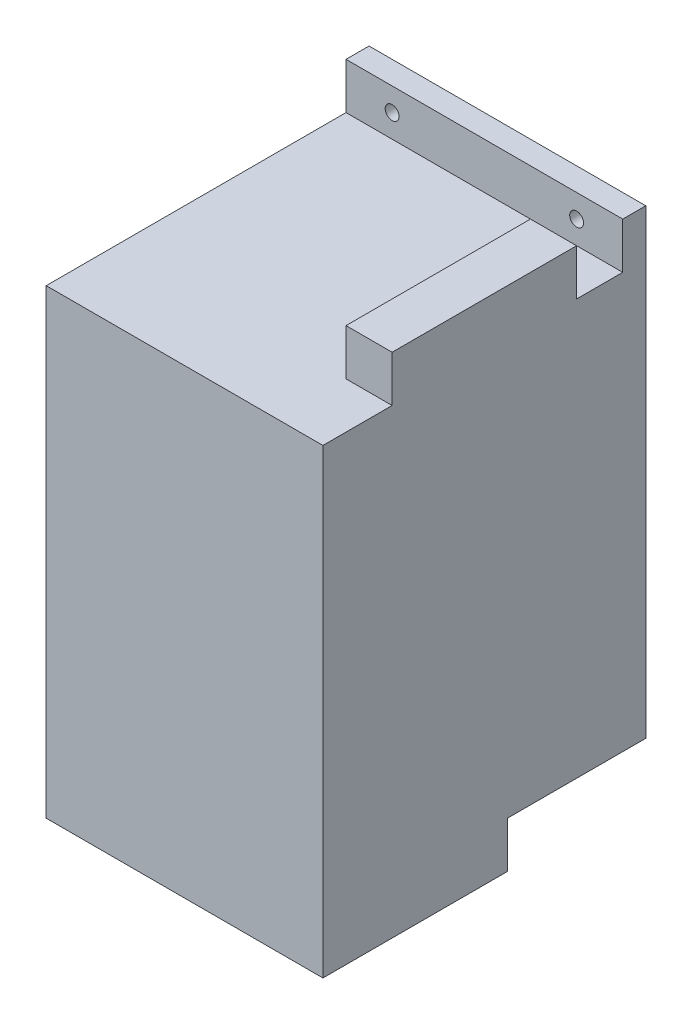
ISO-10303-21;
HEADER;
FILE_DESCRIPTION(('STEP AP214'),'2;1');
FILE_NAME('part.step','',(''),(''),'','','');
FILE_SCHEMA(('AUTOMOTIVE_DESIGN { 1 0 10303 214 1 1 1 1 }'));
ENDSEC;
DATA;
#1=APPLICATION_CONTEXT('core data for automotive mechanical design processes');
#2=APPLICATION_PROTOCOL_DEFINITION('international standard','automotive_design',2000,#1);
#3=PRODUCT_CONTEXT('',#1,'mechanical');
#4=PRODUCT('Part','Part','',(#3));
#5=PRODUCT_RELATED_PRODUCT_CATEGORY('part','',(#4));
#6=PRODUCT_DEFINITION_FORMATION('','',#4);
#7=PRODUCT_DEFINITION_CONTEXT('part definition',#1,'design');
#8=PRODUCT_DEFINITION('design','',#6,#7);
#9=PRODUCT_DEFINITION_SHAPE('','',#8);
#10=(LENGTH_UNIT() NAMED_UNIT(*) SI_UNIT(.MILLI.,.METRE.));
#11=(NAMED_UNIT(*) PLANE_ANGLE_UNIT() SI_UNIT($,.RADIAN.));
#12=(NAMED_UNIT(*) SI_UNIT($,.STERADIAN.) SOLID_ANGLE_UNIT());
#13=UNCERTAINTY_MEASURE_WITH_UNIT(LENGTH_MEASURE(1.E-05),#10,'distance_accuracy_value','');
#14=(GEOMETRIC_REPRESENTATION_CONTEXT(3) GLOBAL_UNCERTAINTY_ASSIGNED_CONTEXT((#13)) GLOBAL_UNIT_ASSIGNED_CONTEXT((#10,
#11,#12)) REPRESENTATION_CONTEXT('',''));
#15=CARTESIAN_POINT('',(0.,0.,0.));
#16=DIRECTION('',(0.,0.,1.));
#17=DIRECTION('',(1.,0.,0.));
#18=AXIS2_PLACEMENT_3D('',#15,#16,#17);
#19=CARTESIAN_POINT('',(0.,100.,-70.));
#20=DIRECTION('',(0.,0.,1.));
#21=DIRECTION('',(1.,0.,0.));
#22=AXIS2_PLACEMENT_3D('',#19,#20,#21);
#23=PLANE('',#22);
#24=CARTESIAN_POINT('',(9.99999999999999,105.,-70.));
#25=DIRECTION('',(0.,0.,-1.));
#26=DIRECTION('',(-1.,0.,0.));
#27=AXIS2_PLACEMENT_3D('',#24,#25,#26);
#28=CIRCLE('',#27,1.5);
#29=CARTESIAN_POINT('',(8.49999999999999,105.,-70.));
#30=VERTEX_POINT('',#29);
#31=EDGE_CURVE('E147',#30,#30,#28,.T.);
#32=ORIENTED_EDGE('',*,*,#31,.F.);
#33=EDGE_LOOP('',(#32));
#34=FACE_BOUND('',#33,.T.);
#35=CARTESIAN_POINT('',(50.,105.,-70.));
#36=DIRECTION('',(0.,0.,-1.));
#37=DIRECTION('',(-1.,0.,0.));
#38=AXIS2_PLACEMENT_3D('',#35,#36,#37);
#39=CIRCLE('',#38,1.5);
#40=CARTESIAN_POINT('',(48.5,105.,-70.));
#41=VERTEX_POINT('',#40);
#42=EDGE_CURVE('E152',#41,#41,#39,.T.);
#43=ORIENTED_EDGE('',*,*,#42,.F.);
#44=EDGE_LOOP('',(#43));
#45=FACE_BOUND('',#44,.T.);
#46=DIRECTION('',(1.,0.,0.));
#47=VECTOR('',#46,1.);
#48=CARTESIAN_POINT('',(60.,10.,-70.));
#49=LINE('',#48,#47);
#50=CARTESIAN_POINT('',(0.,10.,-70.));
#51=VERTEX_POINT('',#50);
#52=CARTESIAN_POINT('',(60.,10.,-70.));
#53=VERTEX_POINT('',#52);
#54=EDGE_CURVE('E136',#51,#53,#49,.T.);
#55=ORIENTED_EDGE('',*,*,#54,.F.);
#56=DIRECTION('',(0.,-1.,0.));
#57=VECTOR('',#56,1.);
#58=CARTESIAN_POINT('',(0.,100.,-70.));
#59=LINE('',#58,#57);
#60=CARTESIAN_POINT('',(0.,110.,-70.));
#61=VERTEX_POINT('',#60);
#62=EDGE_CURVE('E213',#61,#51,#59,.T.);
#63=ORIENTED_EDGE('',*,*,#62,.F.);
#64=DIRECTION('',(-1.,0.,0.));
#65=VECTOR('',#64,1.);
#66=CARTESIAN_POINT('',(60.,110.,-70.));
#67=LINE('',#66,#65);
#68=CARTESIAN_POINT('',(60.,110.,-70.));
#69=VERTEX_POINT('',#68);
#70=EDGE_CURVE('E161',#69,#61,#67,.T.);
#71=ORIENTED_EDGE('',*,*,#70,.F.);
#72=DIRECTION('',(0.,-1.,0.));
#73=VECTOR('',#72,1.);
#74=CARTESIAN_POINT('',(60.,100.,-70.));
#75=LINE('',#74,#73);
#76=EDGE_CURVE('E220',#69,#53,#75,.T.);
#77=ORIENTED_EDGE('',*,*,#76,.T.);
#78=EDGE_LOOP('',(#55,#63,#71,#77));
#79=FACE_BOUND('',#78,.T.);
#80=ADVANCED_FACE('F34',(#34,#45,#79),#23,.F.);
#81=CARTESIAN_POINT('',(0.,100.,0.));
#82=DIRECTION('',(0.,-1.,0.));
#83=DIRECTION('',(0.,0.,-1.));
#84=AXIS2_PLACEMENT_3D('',#81,#82,#83);
#85=PLANE('',#84);
#86=DIRECTION('',(1.,0.,0.));
#87=VECTOR('',#86,1.);
#88=CARTESIAN_POINT('',(60.,100.,-65.));
#89=LINE('',#88,#87);
#90=CARTESIAN_POINT('',(0.,100.,-65.));
#91=VERTEX_POINT('',#90);
#92=CARTESIAN_POINT('',(60.,100.,-65.));
#93=VERTEX_POINT('',#92);
#94=EDGE_CURVE('E59',#91,#93,#89,.T.);
#95=ORIENTED_EDGE('',*,*,#94,.F.);
#96=DIRECTION('',(0.,0.,1.));
#97=VECTOR('',#96,1.);
#98=CARTESIAN_POINT('',(0.,100.,0.));
#99=LINE('',#98,#97);
#100=CARTESIAN_POINT('',(0.,100.,0.));
#101=VERTEX_POINT('',#100);
#102=EDGE_CURVE('E206',#91,#101,#99,.T.);
#103=ORIENTED_EDGE('',*,*,#102,.T.);
#104=DIRECTION('',(1.,0.,0.));
#105=VECTOR('',#104,1.);
#106=CARTESIAN_POINT('',(0.,100.,0.));
#107=LINE('',#106,#105);
#108=CARTESIAN_POINT('',(60.,100.,0.));
#109=VERTEX_POINT('',#108);
#110=EDGE_CURVE('E208',#101,#109,#107,.T.);
#111=ORIENTED_EDGE('',*,*,#110,.T.);
#112=DIRECTION('',(0.,0.,-1.));
#113=VECTOR('',#112,1.);
#114=CARTESIAN_POINT('',(60.,100.,0.));
#115=LINE('',#114,#113);
#116=CARTESIAN_POINT('',(60.,100.,-15.));
#117=VERTEX_POINT('',#116);
#118=EDGE_CURVE('E211',#109,#117,#115,.T.);
#119=ORIENTED_EDGE('',*,*,#118,.T.);
#120=DIRECTION('',(1.,0.,0.));
#121=VECTOR('',#120,1.);
#122=CARTESIAN_POINT('',(50.,100.,-15.));
#123=LINE('',#122,#121);
#124=CARTESIAN_POINT('',(50.,100.,-15.));
#125=VERTEX_POINT('',#124);
#126=EDGE_CURVE('E189',#125,#117,#123,.T.);
#127=ORIENTED_EDGE('',*,*,#126,.F.);
#128=DIRECTION('',(0.,0.,1.));
#129=VECTOR('',#128,1.);
#130=CARTESIAN_POINT('',(50.,100.,-15.));
#131=LINE('',#130,#129);
#132=CARTESIAN_POINT('',(50.,100.,-55.));
#133=VERTEX_POINT('',#132);
#134=EDGE_CURVE('E175',#133,#125,#131,.T.);
#135=ORIENTED_EDGE('',*,*,#134,.F.);
#136=DIRECTION('',(-1.,0.,0.));
#137=VECTOR('',#136,1.);
#138=CARTESIAN_POINT('',(50.,100.,-55.));
#139=LINE('',#138,#137);
#140=CARTESIAN_POINT('',(60.,100.,-55.));
#141=VERTEX_POINT('',#140);
#142=EDGE_CURVE('E180',#141,#133,#139,.T.);
#143=ORIENTED_EDGE('',*,*,#142,.F.);
#144=EDGE_CURVE('E210',#141,#93,#115,.T.);
#145=ORIENTED_EDGE('',*,*,#144,.T.);
#146=EDGE_LOOP('',(#95,#103,#111,#119,#127,#135,#143,#145));
#147=FACE_BOUND('',#146,.T.);
#148=ADVANCED_FACE('F244',(#147),#85,.F.);
#149=CARTESIAN_POINT('',(0.,100.,0.));
#150=DIRECTION('',(1.,0.,0.));
#151=DIRECTION('',(0.,0.,-1.));
#152=AXIS2_PLACEMENT_3D('',#149,#150,#151);
#153=PLANE('',#152);
#154=DIRECTION('',(0.,0.,-1.));
#155=VECTOR('',#154,1.);
#156=CARTESIAN_POINT('',(0.,10.,-70.));
#157=LINE('',#156,#155);
#158=CARTESIAN_POINT('',(0.,10.,-40.));
#159=VERTEX_POINT('',#158);
#160=EDGE_CURVE('E130',#159,#51,#157,.T.);
#161=ORIENTED_EDGE('',*,*,#160,.F.);
#162=DIRECTION('',(0.,-1.,0.));
#163=VECTOR('',#162,1.);
#164=CARTESIAN_POINT('',(0.,10.,-40.));
#165=LINE('',#164,#163);
#166=CARTESIAN_POINT('',(0.,0.,-40.));
#167=VERTEX_POINT('',#166);
#168=EDGE_CURVE('E127',#159,#167,#165,.T.);
#169=ORIENTED_EDGE('',*,*,#168,.T.);
#170=DIRECTION('',(0.,0.,1.));
#171=VECTOR('',#170,1.);
#172=CARTESIAN_POINT('',(0.,0.,0.));
#173=LINE('',#172,#171);
#174=CARTESIAN_POINT('',(0.,0.,0.));
#175=VERTEX_POINT('',#174);
#176=EDGE_CURVE('E205',#167,#175,#173,.T.);
#177=ORIENTED_EDGE('',*,*,#176,.T.);
#178=DIRECTION('',(0.,-1.,0.));
#179=VECTOR('',#178,1.);
#180=CARTESIAN_POINT('',(0.,100.,0.));
#181=LINE('',#180,#179);
#182=EDGE_CURVE('E11',#101,#175,#181,.T.);
#183=ORIENTED_EDGE('',*,*,#182,.F.);
#184=ORIENTED_EDGE('',*,*,#102,.F.);
#185=DIRECTION('',(0.,-1.,0.));
#186=VECTOR('',#185,1.);
#187=CARTESIAN_POINT('',(0.,110.,-65.));
#188=LINE('',#187,#186);
#189=CARTESIAN_POINT('',(0.,110.,-65.));
#190=VERTEX_POINT('',#189);
#191=EDGE_CURVE('E172',#190,#91,#188,.T.);
#192=ORIENTED_EDGE('',*,*,#191,.F.);
#193=DIRECTION('',(0.,0.,1.));
#194=VECTOR('',#193,1.);
#195=CARTESIAN_POINT('',(0.,110.,-70.));
#196=LINE('',#195,#194);
#197=EDGE_CURVE('E164',#61,#190,#196,.T.);
#198=ORIENTED_EDGE('',*,*,#197,.F.);
#199=ORIENTED_EDGE('',*,*,#62,.T.);
#200=EDGE_LOOP('',(#161,#169,#177,#183,#184,#192,#198,#199));
#201=FACE_BOUND('',#200,.T.);
#202=ADVANCED_FACE('F36',(#201),#153,.F.);
#203=CARTESIAN_POINT('',(0.,100.,0.));
#204=DIRECTION('',(0.,0.,-1.));
#205=DIRECTION('',(-1.,0.,0.));
#206=AXIS2_PLACEMENT_3D('',#203,#204,#205);
#207=PLANE('',#206);
#208=DIRECTION('',(1.,0.,0.));
#209=VECTOR('',#208,1.);
#210=CARTESIAN_POINT('',(0.,0.,0.));
#211=LINE('',#210,#209);
#212=CARTESIAN_POINT('',(60.,0.,0.));
#213=VERTEX_POINT('',#212);
#214=EDGE_CURVE('E215',#175,#213,#211,.T.);
#215=ORIENTED_EDGE('',*,*,#214,.T.);
#216=DIRECTION('',(0.,-1.,0.));
#217=VECTOR('',#216,1.);
#218=CARTESIAN_POINT('',(60.,100.,0.));
#219=LINE('',#218,#217);
#220=EDGE_CURVE('E43',#109,#213,#219,.T.);
#221=ORIENTED_EDGE('',*,*,#220,.F.);
#222=ORIENTED_EDGE('',*,*,#110,.F.);
#223=ORIENTED_EDGE('',*,*,#182,.T.);
#224=EDGE_LOOP('',(#215,#221,#222,#223));
#225=FACE_BOUND('',#224,.T.);
#226=ADVANCED_FACE('F257',(#225),#207,.F.);
#227=CARTESIAN_POINT('',(60.,100.,0.));
#228=DIRECTION('',(-1.,0.,0.));
#229=DIRECTION('',(0.,0.,1.));
#230=AXIS2_PLACEMENT_3D('',#227,#228,#229);
#231=PLANE('',#230);
#232=DIRECTION('',(0.,0.,-1.));
#233=VECTOR('',#232,1.);
#234=CARTESIAN_POINT('',(60.,0.,0.));
#235=LINE('',#234,#233);
#236=CARTESIAN_POINT('',(60.,0.,-40.));
#237=VERTEX_POINT('',#236);
#238=EDGE_CURVE('E145',#213,#237,#235,.T.);
#239=ORIENTED_EDGE('',*,*,#238,.T.);
#240=DIRECTION('',(0.,-1.,0.));
#241=VECTOR('',#240,1.);
#242=CARTESIAN_POINT('',(60.,10.,-40.));
#243=LINE('',#242,#241);
#244=CARTESIAN_POINT('',(60.,10.,-40.));
#245=VERTEX_POINT('',#244);
#246=EDGE_CURVE('E51',#245,#237,#243,.T.);
#247=ORIENTED_EDGE('',*,*,#246,.F.);
#248=DIRECTION('',(0.,0.,1.));
#249=VECTOR('',#248,1.);
#250=CARTESIAN_POINT('',(60.,10.,-70.));
#251=LINE('',#250,#249);
#252=EDGE_CURVE('E131',#53,#245,#251,.T.);
#253=ORIENTED_EDGE('',*,*,#252,.F.);
#254=ORIENTED_EDGE('',*,*,#76,.F.);
#255=DIRECTION('',(0.,0.,-1.));
#256=VECTOR('',#255,1.);
#257=CARTESIAN_POINT('',(60.,110.,-70.));
#258=LINE('',#257,#256);
#259=CARTESIAN_POINT('',(60.,110.,-65.));
#260=VERTEX_POINT('',#259);
#261=EDGE_CURVE('E158',#260,#69,#258,.T.);
#262=ORIENTED_EDGE('',*,*,#261,.F.);
#263=DIRECTION('',(0.,-1.,0.));
#264=VECTOR('',#263,1.);
#265=CARTESIAN_POINT('',(60.,110.,-65.));
#266=LINE('',#265,#264);
#267=EDGE_CURVE('E168',#260,#93,#266,.T.);
#268=ORIENTED_EDGE('',*,*,#267,.T.);
#269=ORIENTED_EDGE('',*,*,#144,.F.);
#270=DIRECTION('',(0.,-1.,0.));
#271=VECTOR('',#270,1.);
#272=CARTESIAN_POINT('',(60.,110.,-55.));
#273=LINE('',#272,#271);
#274=CARTESIAN_POINT('',(60.,110.,-55.));
#275=VERTEX_POINT('',#274);
#276=EDGE_CURVE('E196',#275,#141,#273,.T.);
#277=ORIENTED_EDGE('',*,*,#276,.F.);
#278=DIRECTION('',(0.,0.,-1.));
#279=VECTOR('',#278,1.);
#280=CARTESIAN_POINT('',(60.,110.,-15.));
#281=LINE('',#280,#279);
#282=CARTESIAN_POINT('',(60.,110.,-15.));
#283=VERTEX_POINT('',#282);
#284=EDGE_CURVE('E182',#283,#275,#281,.T.);
#285=ORIENTED_EDGE('',*,*,#284,.F.);
#286=DIRECTION('',(0.,-1.,0.));
#287=VECTOR('',#286,1.);
#288=CARTESIAN_POINT('',(60.,110.,-15.));
#289=LINE('',#288,#287);
#290=EDGE_CURVE('E199',#283,#117,#289,.T.);
#291=ORIENTED_EDGE('',*,*,#290,.T.);
#292=ORIENTED_EDGE('',*,*,#118,.F.);
#293=ORIENTED_EDGE('',*,*,#220,.T.);
#294=EDGE_LOOP('',(#239,#247,#253,#254,#262,#268,#269,#277,#285,#291,#292,#293));
#295=FACE_BOUND('',#294,.T.);
#296=ADVANCED_FACE('F142',(#295),#231,.F.);
#297=CARTESIAN_POINT('',(0.,0.,0.));
#298=DIRECTION('',(0.,-1.,0.));
#299=DIRECTION('',(0.,0.,-1.));
#300=AXIS2_PLACEMENT_3D('',#297,#298,#299);
#301=PLANE('',#300);
#302=DIRECTION('',(-1.,0.,0.));
#303=VECTOR('',#302,1.);
#304=CARTESIAN_POINT('',(60.,0.,-40.));
#305=LINE('',#304,#303);
#306=EDGE_CURVE('E139',#237,#167,#305,.T.);
#307=ORIENTED_EDGE('',*,*,#306,.F.);
#308=ORIENTED_EDGE('',*,*,#238,.F.);
#309=ORIENTED_EDGE('',*,*,#214,.F.);
#310=ORIENTED_EDGE('',*,*,#176,.F.);
#311=EDGE_LOOP('',(#307,#308,#309,#310));
#312=FACE_BOUND('',#311,.T.);
#313=ADVANCED_FACE('F255',(#312),#301,.T.);
#314=CARTESIAN_POINT('',(50.,110.,-15.));
#315=DIRECTION('',(1.,0.,0.));
#316=DIRECTION('',(0.,0.,-1.));
#317=AXIS2_PLACEMENT_3D('',#314,#315,#316);
#318=PLANE('',#317);
#319=ORIENTED_EDGE('',*,*,#134,.T.);
#320=DIRECTION('',(0.,-1.,0.));
#321=VECTOR('',#320,1.);
#322=CARTESIAN_POINT('',(50.,110.,-15.));
#323=LINE('',#322,#321);
#324=CARTESIAN_POINT('',(50.,110.,-15.));
#325=VERTEX_POINT('',#324);
#326=EDGE_CURVE('E202',#325,#125,#323,.T.);
#327=ORIENTED_EDGE('',*,*,#326,.F.);
#328=DIRECTION('',(0.,0.,1.));
#329=VECTOR('',#328,1.);
#330=CARTESIAN_POINT('',(50.,110.,-15.));
#331=LINE('',#330,#329);
#332=CARTESIAN_POINT('',(50.,110.,-55.));
#333=VERTEX_POINT('',#332);
#334=EDGE_CURVE('E176',#333,#325,#331,.T.);
#335=ORIENTED_EDGE('',*,*,#334,.F.);
#336=DIRECTION('',(0.,-1.,0.));
#337=VECTOR('',#336,1.);
#338=CARTESIAN_POINT('',(50.,110.,-55.));
#339=LINE('',#338,#337);
#340=EDGE_CURVE('E186',#333,#133,#339,.T.);
#341=ORIENTED_EDGE('',*,*,#340,.T.);
#342=EDGE_LOOP('',(#319,#327,#335,#341));
#343=FACE_BOUND('',#342,.T.);
#344=ADVANCED_FACE('F301',(#343),#318,.F.);
#345=CARTESIAN_POINT('',(50.,110.,-15.));
#346=DIRECTION('',(0.,0.,-1.));
#347=DIRECTION('',(-1.,0.,0.));
#348=AXIS2_PLACEMENT_3D('',#345,#346,#347);
#349=PLANE('',#348);
#350=ORIENTED_EDGE('',*,*,#126,.T.);
#351=ORIENTED_EDGE('',*,*,#290,.F.);
#352=DIRECTION('',(1.,0.,0.));
#353=VECTOR('',#352,1.);
#354=CARTESIAN_POINT('',(50.,110.,-15.));
#355=LINE('',#354,#353);
#356=EDGE_CURVE('E179',#325,#283,#355,.T.);
#357=ORIENTED_EDGE('',*,*,#356,.F.);
#358=ORIENTED_EDGE('',*,*,#326,.T.);
#359=EDGE_LOOP('',(#350,#351,#357,#358));
#360=FACE_BOUND('',#359,.T.);
#361=ADVANCED_FACE('F297',(#360),#349,.F.);
#362=CARTESIAN_POINT('',(50.,110.,-55.));
#363=DIRECTION('',(0.,0.,1.));
#364=DIRECTION('',(1.,0.,0.));
#365=AXIS2_PLACEMENT_3D('',#362,#363,#364);
#366=PLANE('',#365);
#367=ORIENTED_EDGE('',*,*,#142,.T.);
#368=ORIENTED_EDGE('',*,*,#340,.F.);
#369=DIRECTION('',(-1.,0.,0.));
#370=VECTOR('',#369,1.);
#371=CARTESIAN_POINT('',(50.,110.,-55.));
#372=LINE('',#371,#370);
#373=EDGE_CURVE('E184',#275,#333,#372,.T.);
#374=ORIENTED_EDGE('',*,*,#373,.F.);
#375=ORIENTED_EDGE('',*,*,#276,.T.);
#376=EDGE_LOOP('',(#367,#368,#374,#375));
#377=FACE_BOUND('',#376,.T.);
#378=ADVANCED_FACE('F291',(#377),#366,.F.);
#379=CARTESIAN_POINT('',(0.,110.,0.));
#380=DIRECTION('',(0.,-1.,0.));
#381=DIRECTION('',(0.,0.,-1.));
#382=AXIS2_PLACEMENT_3D('',#379,#380,#381);
#383=PLANE('',#382);
#384=ORIENTED_EDGE('',*,*,#334,.T.);
#385=ORIENTED_EDGE('',*,*,#356,.T.);
#386=ORIENTED_EDGE('',*,*,#284,.T.);
#387=ORIENTED_EDGE('',*,*,#373,.T.);
#388=EDGE_LOOP('',(#384,#385,#386,#387));
#389=FACE_BOUND('',#388,.T.);
#390=ADVANCED_FACE('F284',(#389),#383,.F.);
#391=CARTESIAN_POINT('',(60.,110.,-65.));
#392=DIRECTION('',(0.,0.,-1.));
#393=DIRECTION('',(-1.,0.,0.));
#394=AXIS2_PLACEMENT_3D('',#391,#392,#393);
#395=PLANE('',#394);
#396=CARTESIAN_POINT('',(50.,105.,-65.));
#397=DIRECTION('',(0.,0.,-1.));
#398=DIRECTION('',(-1.,0.,0.));
#399=AXIS2_PLACEMENT_3D('',#396,#397,#398);
#400=CIRCLE('',#399,1.5);
#401=CARTESIAN_POINT('',(48.5,105.,-65.));
#402=VERTEX_POINT('',#401);
#403=EDGE_CURVE('E38',#402,#402,#400,.T.);
#404=ORIENTED_EDGE('',*,*,#403,.T.);
#405=EDGE_LOOP('',(#404));
#406=FACE_BOUND('',#405,.T.);
#407=CARTESIAN_POINT('',(9.99999999999999,105.,-65.));
#408=DIRECTION('',(0.,0.,-1.));
#409=DIRECTION('',(-1.,0.,0.));
#410=AXIS2_PLACEMENT_3D('',#407,#408,#409);
#411=CIRCLE('',#410,1.5);
#412=CARTESIAN_POINT('',(8.49999999999999,105.,-65.));
#413=VERTEX_POINT('',#412);
#414=EDGE_CURVE('E155',#413,#413,#411,.T.);
#415=ORIENTED_EDGE('',*,*,#414,.T.);
#416=EDGE_LOOP('',(#415));
#417=FACE_BOUND('',#416,.T.);
#418=ORIENTED_EDGE('',*,*,#94,.T.);
#419=ORIENTED_EDGE('',*,*,#267,.F.);
#420=DIRECTION('',(1.,0.,0.));
#421=VECTOR('',#420,1.);
#422=CARTESIAN_POINT('',(60.,110.,-65.));
#423=LINE('',#422,#421);
#424=EDGE_CURVE('E166',#190,#260,#423,.T.);
#425=ORIENTED_EDGE('',*,*,#424,.F.);
#426=ORIENTED_EDGE('',*,*,#191,.T.);
#427=EDGE_LOOP('',(#418,#419,#425,#426));
#428=FACE_BOUND('',#427,.T.);
#429=ADVANCED_FACE('F228',(#406,#417,#428),#395,.F.);
#430=CARTESIAN_POINT('',(0.,110.,0.));
#431=DIRECTION('',(0.,-1.,0.));
#432=DIRECTION('',(0.,0.,-1.));
#433=AXIS2_PLACEMENT_3D('',#430,#431,#432);
#434=PLANE('',#433);
#435=ORIENTED_EDGE('',*,*,#261,.T.);
#436=ORIENTED_EDGE('',*,*,#70,.T.);
#437=ORIENTED_EDGE('',*,*,#197,.T.);
#438=ORIENTED_EDGE('',*,*,#424,.T.);
#439=EDGE_LOOP('',(#435,#436,#437,#438));
#440=FACE_BOUND('',#439,.T.);
#441=ADVANCED_FACE('F240',(#440),#434,.F.);
#442=CARTESIAN_POINT('',(9.99999999999999,105.,-60.));
#443=DIRECTION('',(0.,0.,-1.));
#444=DIRECTION('',(-1.,0.,0.));
#445=AXIS2_PLACEMENT_3D('',#442,#443,#444);
#446=CYLINDRICAL_SURFACE('',#445,1.5);
#447=ORIENTED_EDGE('',*,*,#31,.T.);
#448=EDGE_LOOP('',(#447));
#449=FACE_BOUND('',#448,.T.);
#450=ORIENTED_EDGE('',*,*,#414,.F.);
#451=EDGE_LOOP('',(#450));
#452=FACE_BOUND('',#451,.T.);
#453=ADVANCED_FACE('F232',(#449,#452),#446,.F.);
#454=CARTESIAN_POINT('',(50.,105.,-60.));
#455=DIRECTION('',(0.,0.,-1.));
#456=DIRECTION('',(-1.,0.,0.));
#457=AXIS2_PLACEMENT_3D('',#454,#455,#456);
#458=CYLINDRICAL_SURFACE('',#457,1.5);
#459=ORIENTED_EDGE('',*,*,#42,.T.);
#460=EDGE_LOOP('',(#459));
#461=FACE_BOUND('',#460,.T.);
#462=ORIENTED_EDGE('',*,*,#403,.F.);
#463=EDGE_LOOP('',(#462));
#464=FACE_BOUND('',#463,.T.);
#465=ADVANCED_FACE('F230',(#461,#464),#458,.F.);
#466=CARTESIAN_POINT('',(60.,10.,-40.));
#467=DIRECTION('',(0.,0.,1.));
#468=DIRECTION('',(1.,0.,0.));
#469=AXIS2_PLACEMENT_3D('',#466,#467,#468);
#470=PLANE('',#469);
#471=ORIENTED_EDGE('',*,*,#306,.T.);
#472=ORIENTED_EDGE('',*,*,#168,.F.);
#473=DIRECTION('',(-1.,0.,0.));
#474=VECTOR('',#473,1.);
#475=CARTESIAN_POINT('',(60.,10.,-40.));
#476=LINE('',#475,#474);
#477=EDGE_CURVE('E123',#245,#159,#476,.T.);
#478=ORIENTED_EDGE('',*,*,#477,.F.);
#479=ORIENTED_EDGE('',*,*,#246,.T.);
#480=EDGE_LOOP('',(#471,#472,#478,#479));
#481=FACE_BOUND('',#480,.T.);
#482=ADVANCED_FACE('F125',(#481),#470,.F.);
#483=CARTESIAN_POINT('',(0.,10.,0.));
#484=DIRECTION('',(0.,-1.,0.));
#485=DIRECTION('',(0.,0.,-1.));
#486=AXIS2_PLACEMENT_3D('',#483,#484,#485);
#487=PLANE('',#486);
#488=ORIENTED_EDGE('',*,*,#252,.T.);
#489=ORIENTED_EDGE('',*,*,#477,.T.);
#490=ORIENTED_EDGE('',*,*,#160,.T.);
#491=ORIENTED_EDGE('',*,*,#54,.T.);
#492=EDGE_LOOP('',(#488,#489,#490,#491));
#493=FACE_BOUND('',#492,.T.);
#494=ADVANCED_FACE('F134',(#493),#487,.T.);
#495=CLOSED_SHELL('',(#80,#148,#202,#226,#296,#313,#344,#361,#378,#390,#429,#441,#453,#465,#482,#494));
#496=MANIFOLD_SOLID_BREP('B2',#495);
#497=ADVANCED_BREP_SHAPE_REPRESENTATION('',(#18,#496),#14);
#498=SHAPE_DEFINITION_REPRESENTATION(#9,#497);
ENDSEC;
END-ISO-10303-21;
